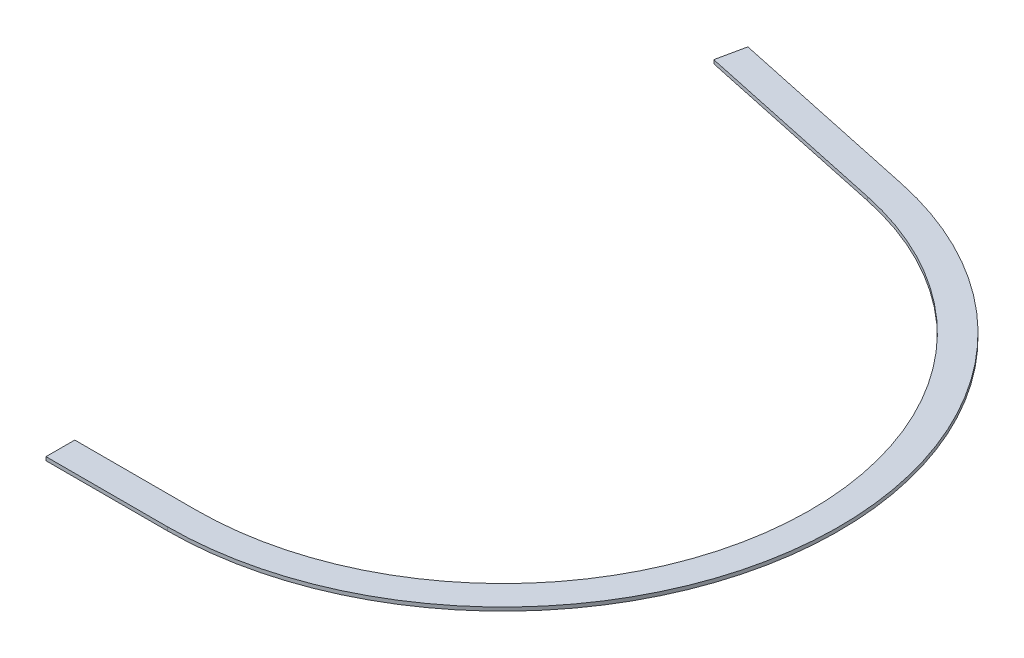
ISO-10303-21;
HEADER;
FILE_DESCRIPTION(('STEP AP214'),'2;1');
FILE_NAME('part.step','',(''),(''),'','','');
FILE_SCHEMA(('AUTOMOTIVE_DESIGN { 1 0 10303 214 1 1 1 1 }'));
ENDSEC;
DATA;
#1=APPLICATION_CONTEXT('core data for automotive mechanical design processes');
#2=APPLICATION_PROTOCOL_DEFINITION('international standard','automotive_design',2000,#1);
#3=PRODUCT_CONTEXT('',#1,'mechanical');
#4=PRODUCT('Part','Part','',(#3));
#5=PRODUCT_RELATED_PRODUCT_CATEGORY('part','',(#4));
#6=PRODUCT_DEFINITION_FORMATION('','',#4);
#7=PRODUCT_DEFINITION_CONTEXT('part definition',#1,'design');
#8=PRODUCT_DEFINITION('design','',#6,#7);
#9=PRODUCT_DEFINITION_SHAPE('','',#8);
#10=(LENGTH_UNIT() NAMED_UNIT(*) SI_UNIT(.MILLI.,.METRE.));
#11=(NAMED_UNIT(*) PLANE_ANGLE_UNIT() SI_UNIT($,.RADIAN.));
#12=(NAMED_UNIT(*) SI_UNIT($,.STERADIAN.) SOLID_ANGLE_UNIT());
#13=UNCERTAINTY_MEASURE_WITH_UNIT(LENGTH_MEASURE(1.E-05),#10,'distance_accuracy_value','');
#14=(GEOMETRIC_REPRESENTATION_CONTEXT(3) GLOBAL_UNCERTAINTY_ASSIGNED_CONTEXT((#13)) GLOBAL_UNIT_ASSIGNED_CONTEXT((#10,
#11,#12)) REPRESENTATION_CONTEXT('',''));
#15=CARTESIAN_POINT('',(0.,0.,0.));
#16=DIRECTION('',(0.,0.,1.));
#17=DIRECTION('',(1.,0.,0.));
#18=AXIS2_PLACEMENT_3D('',#15,#16,#17);
#19=CARTESIAN_POINT('',(9316.67286903884,3625.,2518.5263673959));
#20=DIRECTION('',(0.,-1.,0.));
#21=DIRECTION('',(0.,0.,-1.));
#22=AXIS2_PLACEMENT_3D('',#19,#20,#21);
#23=CYLINDRICAL_SURFACE('',#22,2135.);
#24=CARTESIAN_POINT('',(9316.67286903884,3600.,2518.5263673959));
#25=DIRECTION('',(0.,1.,0.));
#26=DIRECTION('',(0.,0.,1.));
#27=AXIS2_PLACEMENT_3D('',#24,#25,#26);
#28=CIRCLE('',#27,2135.);
#29=CARTESIAN_POINT('',(9316.67286903884,3600.,4653.5263673959));
#30=VERTEX_POINT('',#29);
#31=CARTESIAN_POINT('',(9762.19434389904,3600.,430.528375194188));
#32=VERTEX_POINT('',#31);
#33=EDGE_CURVE('E129',#30,#32,#28,.T.);
#34=ORIENTED_EDGE('',*,*,#33,.F.);
#35=DIRECTION('',(0.,-1.,0.));
#36=VECTOR('',#35,1.);
#37=CARTESIAN_POINT('',(9316.67286903884,3625.,4653.5263673959));
#38=LINE('',#37,#36);
#39=CARTESIAN_POINT('',(9316.67286903884,3625.,4653.5263673959));
#40=VERTEX_POINT('',#39);
#41=EDGE_CURVE('E11',#40,#30,#38,.T.);
#42=ORIENTED_EDGE('',*,*,#41,.F.);
#43=CARTESIAN_POINT('',(9316.67286903884,3625.,2518.5263673959));
#44=DIRECTION('',(0.,1.,0.));
#45=DIRECTION('',(0.,0.,1.));
#46=AXIS2_PLACEMENT_3D('',#43,#44,#45);
#47=CIRCLE('',#46,2135.);
#48=CARTESIAN_POINT('',(9762.19434389904,3625.,430.528375194188));
#49=VERTEX_POINT('',#48);
#50=EDGE_CURVE('E147',#40,#49,#47,.T.);
#51=ORIENTED_EDGE('',*,*,#50,.T.);
#52=DIRECTION('',(0.,-1.,0.));
#53=VECTOR('',#52,1.);
#54=CARTESIAN_POINT('',(9762.19434389904,3625.,430.528375194188));
#55=LINE('',#54,#53);
#56=EDGE_CURVE('E84',#49,#32,#55,.T.);
#57=ORIENTED_EDGE('',*,*,#56,.T.);
#58=EDGE_LOOP('',(#34,#42,#51,#57));
#59=FACE_BOUND('',#58,.T.);
#60=ADVANCED_FACE('F34',(#59),#23,.F.);
#61=CARTESIAN_POINT('',(4.89131561541606E-12,3625.,4653.52636739591));
#62=DIRECTION('',(0.,0.,1.));
#63=DIRECTION('',(1.,0.,0.));
#64=AXIS2_PLACEMENT_3D('',#61,#62,#63);
#65=PLANE('',#64);
#66=DIRECTION('',(-1.,0.,0.));
#67=VECTOR('',#66,1.);
#68=CARTESIAN_POINT('',(4.89131561541606E-12,3600.,4653.52636739591));
#69=LINE('',#68,#67);
#70=CARTESIAN_POINT('',(8471.67286903884,3600.,4653.5263673959));
#71=VERTEX_POINT('',#70);
#72=EDGE_CURVE('E132',#30,#71,#69,.T.);
#73=ORIENTED_EDGE('',*,*,#72,.T.);
#74=DIRECTION('',(0.,-1.,0.));
#75=VECTOR('',#74,1.);
#76=CARTESIAN_POINT('',(8471.67286903884,3625.,4653.5263673959));
#77=LINE('',#76,#75);
#78=CARTESIAN_POINT('',(8471.67286903884,3625.,4653.5263673959));
#79=VERTEX_POINT('',#78);
#80=EDGE_CURVE('E42',#79,#71,#77,.T.);
#81=ORIENTED_EDGE('',*,*,#80,.F.);
#82=DIRECTION('',(-1.,0.,0.));
#83=VECTOR('',#82,1.);
#84=CARTESIAN_POINT('',(4.89131561541606E-12,3625.,4653.52636739591));
#85=LINE('',#84,#83);
#86=EDGE_CURVE('E171',#40,#79,#85,.T.);
#87=ORIENTED_EDGE('',*,*,#86,.F.);
#88=ORIENTED_EDGE('',*,*,#41,.T.);
#89=EDGE_LOOP('',(#73,#81,#87,#88));
#90=FACE_BOUND('',#89,.T.);
#91=ADVANCED_FACE('F175',(#90),#65,.F.);
#92=CARTESIAN_POINT('',(8471.67286903884,3625.,0.));
#93=DIRECTION('',(1.,0.,0.));
#94=DIRECTION('',(0.,0.,-1.));
#95=AXIS2_PLACEMENT_3D('',#92,#93,#94);
#96=PLANE('',#95);
#97=DIRECTION('',(0.,0.,1.));
#98=VECTOR('',#97,1.);
#99=CARTESIAN_POINT('',(8471.67286903884,3600.,0.));
#100=LINE('',#99,#98);
#101=CARTESIAN_POINT('',(8471.67286903884,3600.,4853.5263673959));
#102=VERTEX_POINT('',#101);
#103=EDGE_CURVE('E134',#71,#102,#100,.T.);
#104=ORIENTED_EDGE('',*,*,#103,.T.);
#105=DIRECTION('',(0.,-1.,0.));
#106=VECTOR('',#105,1.);
#107=CARTESIAN_POINT('',(8471.67286903884,3625.,4853.5263673959));
#108=LINE('',#107,#106);
#109=CARTESIAN_POINT('',(8471.67286903884,3625.,4853.5263673959));
#110=VERTEX_POINT('',#109);
#111=EDGE_CURVE('E153',#110,#102,#108,.T.);
#112=ORIENTED_EDGE('',*,*,#111,.F.);
#113=DIRECTION('',(0.,0.,1.));
#114=VECTOR('',#113,1.);
#115=CARTESIAN_POINT('',(8471.67286903884,3625.,0.));
#116=LINE('',#115,#114);
#117=EDGE_CURVE('E161',#79,#110,#116,.T.);
#118=ORIENTED_EDGE('',*,*,#117,.F.);
#119=ORIENTED_EDGE('',*,*,#80,.T.);
#120=EDGE_LOOP('',(#104,#112,#118,#119));
#121=FACE_BOUND('',#120,.T.);
#122=ADVANCED_FACE('F159',(#121),#96,.F.);
#123=CARTESIAN_POINT('',(5.10153535972378E-12,3625.,4853.52636739591));
#124=DIRECTION('',(0.,0.,1.));
#125=DIRECTION('',(1.,0.,0.));
#126=AXIS2_PLACEMENT_3D('',#123,#124,#125);
#127=PLANE('',#126);
#128=DIRECTION('',(-1.,0.,0.));
#129=VECTOR('',#128,1.);
#130=CARTESIAN_POINT('',(5.10153535972378E-12,3600.,4853.52636739591));
#131=LINE('',#130,#129);
#132=CARTESIAN_POINT('',(9316.67286903884,3600.,4853.5263673959));
#133=VERTEX_POINT('',#132);
#134=EDGE_CURVE('E137',#133,#102,#131,.T.);
#135=ORIENTED_EDGE('',*,*,#134,.F.);
#136=DIRECTION('',(0.,-1.,0.));
#137=VECTOR('',#136,1.);
#138=CARTESIAN_POINT('',(9316.67286903884,3625.,4853.5263673959));
#139=LINE('',#138,#137);
#140=CARTESIAN_POINT('',(9316.67286903884,3625.,4853.5263673959));
#141=VERTEX_POINT('',#140);
#142=EDGE_CURVE('E151',#141,#133,#139,.T.);
#143=ORIENTED_EDGE('',*,*,#142,.F.);
#144=DIRECTION('',(-1.,0.,0.));
#145=VECTOR('',#144,1.);
#146=CARTESIAN_POINT('',(5.10153535972378E-12,3625.,4853.52636739591));
#147=LINE('',#146,#145);
#148=EDGE_CURVE('E124',#141,#110,#147,.T.);
#149=ORIENTED_EDGE('',*,*,#148,.T.);
#150=ORIENTED_EDGE('',*,*,#111,.T.);
#151=EDGE_LOOP('',(#135,#143,#149,#150));
#152=FACE_BOUND('',#151,.T.);
#153=ADVANCED_FACE('F169',(#152),#127,.T.);
#154=CARTESIAN_POINT('',(9316.67286903884,3625.,2518.5263673959));
#155=DIRECTION('',(0.,-1.,0.));
#156=DIRECTION('',(0.,0.,-1.));
#157=AXIS2_PLACEMENT_3D('',#154,#155,#156);
#158=CYLINDRICAL_SURFACE('',#157,2335.);
#159=CARTESIAN_POINT('',(9316.67286903884,3600.,2518.5263673959));
#160=DIRECTION('',(0.,1.,0.));
#161=DIRECTION('',(0.,0.,1.));
#162=AXIS2_PLACEMENT_3D('',#159,#160,#161);
#163=CIRCLE('',#162,2335.);
#164=CARTESIAN_POINT('',(9803.92937667284,3600.,234.931373582788));
#165=VERTEX_POINT('',#164);
#166=EDGE_CURVE('E140',#133,#165,#163,.T.);
#167=ORIENTED_EDGE('',*,*,#166,.T.);
#168=DIRECTION('',(0.,-1.,0.));
#169=VECTOR('',#168,1.);
#170=CARTESIAN_POINT('',(9803.92937667284,3625.,234.931373582788));
#171=LINE('',#170,#169);
#172=CARTESIAN_POINT('',(9803.92937667284,3625.,234.931373582788));
#173=VERTEX_POINT('',#172);
#174=EDGE_CURVE('E112',#173,#165,#171,.T.);
#175=ORIENTED_EDGE('',*,*,#174,.F.);
#176=CARTESIAN_POINT('',(9316.67286903884,3625.,2518.5263673959));
#177=DIRECTION('',(0.,1.,0.));
#178=DIRECTION('',(0.,0.,1.));
#179=AXIS2_PLACEMENT_3D('',#176,#177,#178);
#180=CIRCLE('',#179,2335.);
#181=EDGE_CURVE('E121',#141,#173,#180,.T.);
#182=ORIENTED_EDGE('',*,*,#181,.F.);
#183=ORIENTED_EDGE('',*,*,#142,.T.);
#184=EDGE_LOOP('',(#167,#175,#182,#183));
#185=FACE_BOUND('',#184,.T.);
#186=ADVANCED_FACE('F185',(#185),#158,.T.);
#187=CARTESIAN_POINT('',(378.97020896775,3625.,-1776.09628284971));
#188=DIRECTION('',(0.208675163868948,0.,-0.977985008057009));
#189=DIRECTION('',(-0.977985008057009,0.,-0.208675163868948));
#190=AXIS2_PLACEMENT_3D('',#187,#188,#189);
#191=PLANE('',#190);
#192=DIRECTION('',(0.977985008057009,0.,0.208675163868948));
#193=VECTOR('',#192,1.);
#194=CARTESIAN_POINT('',(378.97020896775,3600.,-1776.09628284971));
#195=LINE('',#194,#193);
#196=CARTESIAN_POINT('',(8444.53021547359,3600.,-55.1271041950507));
#197=VERTEX_POINT('',#196);
#198=EDGE_CURVE('E111',#197,#165,#195,.T.);
#199=ORIENTED_EDGE('',*,*,#198,.F.);
#200=DIRECTION('',(0.,-1.,0.));
#201=VECTOR('',#200,1.);
#202=CARTESIAN_POINT('',(8444.53021547359,3625.,-55.1271041950507));
#203=LINE('',#202,#201);
#204=CARTESIAN_POINT('',(8444.53021547359,3625.,-55.1271041950507));
#205=VERTEX_POINT('',#204);
#206=EDGE_CURVE('E105',#205,#197,#203,.T.);
#207=ORIENTED_EDGE('',*,*,#206,.F.);
#208=DIRECTION('',(0.977985008057009,0.,0.208675163868948));
#209=VECTOR('',#208,1.);
#210=CARTESIAN_POINT('',(378.97020896775,3625.,-1776.09628284971));
#211=LINE('',#210,#209);
#212=EDGE_CURVE('E109',#205,#173,#211,.T.);
#213=ORIENTED_EDGE('',*,*,#212,.T.);
#214=ORIENTED_EDGE('',*,*,#174,.T.);
#215=EDGE_LOOP('',(#199,#207,#213,#214));
#216=FACE_BOUND('',#215,.T.);
#217=ADVANCED_FACE('F107',(#216),#191,.T.);
#218=CARTESIAN_POINT('',(8065.56000650584,3625.,1720.96917865466));
#219=DIRECTION('',(0.977985008057009,0.,0.208675163868949));
#220=DIRECTION('',(0.208675163868949,0.,-0.977985008057009));
#221=AXIS2_PLACEMENT_3D('',#218,#219,#220);
#222=PLANE('',#221);
#223=DIRECTION('',(-0.208675163868949,0.,0.977985008057009));
#224=VECTOR('',#223,1.);
#225=CARTESIAN_POINT('',(8065.56000650584,3600.,1720.96917865466));
#226=LINE('',#225,#224);
#227=CARTESIAN_POINT('',(8402.7951826998,3600.,140.469897416351));
#228=VERTEX_POINT('',#227);
#229=EDGE_CURVE('E77',#197,#228,#226,.T.);
#230=ORIENTED_EDGE('',*,*,#229,.T.);
#231=DIRECTION('',(0.,-1.,0.));
#232=VECTOR('',#231,1.);
#233=CARTESIAN_POINT('',(8402.7951826998,3625.,140.469897416351));
#234=LINE('',#233,#232);
#235=CARTESIAN_POINT('',(8402.7951826998,3625.,140.469897416351));
#236=VERTEX_POINT('',#235);
#237=EDGE_CURVE('E113',#236,#228,#234,.T.);
#238=ORIENTED_EDGE('',*,*,#237,.F.);
#239=DIRECTION('',(-0.208675163868949,0.,0.977985008057009));
#240=VECTOR('',#239,1.);
#241=CARTESIAN_POINT('',(8065.56000650584,3625.,1720.96917865466));
#242=LINE('',#241,#240);
#243=EDGE_CURVE('E115',#205,#236,#242,.T.);
#244=ORIENTED_EDGE('',*,*,#243,.F.);
#245=ORIENTED_EDGE('',*,*,#206,.T.);
#246=EDGE_LOOP('',(#230,#238,#244,#245));
#247=FACE_BOUND('',#246,.T.);
#248=ADVANCED_FACE('F116',(#247),#222,.F.);
#249=CARTESIAN_POINT('',(337.235176193961,3625.,-1580.49928123831));
#250=DIRECTION('',(0.208675163868948,0.,-0.977985008057009));
#251=DIRECTION('',(-0.977985008057009,0.,-0.208675163868948));
#252=AXIS2_PLACEMENT_3D('',#249,#250,#251);
#253=PLANE('',#252);
#254=DIRECTION('',(0.977985008057009,0.,0.208675163868948));
#255=VECTOR('',#254,1.);
#256=CARTESIAN_POINT('',(337.235176193961,3600.,-1580.49928123831));
#257=LINE('',#256,#255);
#258=EDGE_CURVE('E145',#228,#32,#257,.T.);
#259=ORIENTED_EDGE('',*,*,#258,.T.);
#260=ORIENTED_EDGE('',*,*,#56,.F.);
#261=DIRECTION('',(0.977985008057009,0.,0.208675163868948));
#262=VECTOR('',#261,1.);
#263=CARTESIAN_POINT('',(337.235176193961,3625.,-1580.49928123831));
#264=LINE('',#263,#262);
#265=EDGE_CURVE('E50',#236,#49,#264,.T.);
#266=ORIENTED_EDGE('',*,*,#265,.F.);
#267=ORIENTED_EDGE('',*,*,#237,.T.);
#268=EDGE_LOOP('',(#259,#260,#266,#267));
#269=FACE_BOUND('',#268,.T.);
#270=ADVANCED_FACE('F193',(#269),#253,.F.);
#271=CARTESIAN_POINT('',(0.,3625.,0.));
#272=DIRECTION('',(0.,1.,0.));
#273=DIRECTION('',(0.,0.,1.));
#274=AXIS2_PLACEMENT_3D('',#271,#272,#273);
#275=PLANE('',#274);
#276=ORIENTED_EDGE('',*,*,#50,.F.);
#277=ORIENTED_EDGE('',*,*,#86,.T.);
#278=ORIENTED_EDGE('',*,*,#117,.T.);
#279=ORIENTED_EDGE('',*,*,#148,.F.);
#280=ORIENTED_EDGE('',*,*,#181,.T.);
#281=ORIENTED_EDGE('',*,*,#212,.F.);
#282=ORIENTED_EDGE('',*,*,#243,.T.);
#283=ORIENTED_EDGE('',*,*,#265,.T.);
#284=EDGE_LOOP('',(#276,#277,#278,#279,#280,#281,#282,#283));
#285=FACE_BOUND('',#284,.T.);
#286=ADVANCED_FACE('F118',(#285),#275,.T.);
#287=CARTESIAN_POINT('',(0.,3600.,0.));
#288=DIRECTION('',(0.,1.,0.));
#289=DIRECTION('',(0.,0.,1.));
#290=AXIS2_PLACEMENT_3D('',#287,#288,#289);
#291=PLANE('',#290);
#292=ORIENTED_EDGE('',*,*,#33,.T.);
#293=ORIENTED_EDGE('',*,*,#258,.F.);
#294=ORIENTED_EDGE('',*,*,#229,.F.);
#295=ORIENTED_EDGE('',*,*,#198,.T.);
#296=ORIENTED_EDGE('',*,*,#166,.F.);
#297=ORIENTED_EDGE('',*,*,#134,.T.);
#298=ORIENTED_EDGE('',*,*,#103,.F.);
#299=ORIENTED_EDGE('',*,*,#72,.F.);
#300=EDGE_LOOP('',(#292,#293,#294,#295,#296,#297,#298,#299));
#301=FACE_BOUND('',#300,.T.);
#302=ADVANCED_FACE('F165',(#301),#291,.F.);
#303=CLOSED_SHELL('',(#60,#91,#122,#153,#186,#217,#248,#270,#286,#302));
#304=MANIFOLD_SOLID_BREP('B2',#303);
#305=ADVANCED_BREP_SHAPE_REPRESENTATION('',(#18,#304),#14);
#306=SHAPE_DEFINITION_REPRESENTATION(#9,#305);
ENDSEC;
END-ISO-10303-21;
